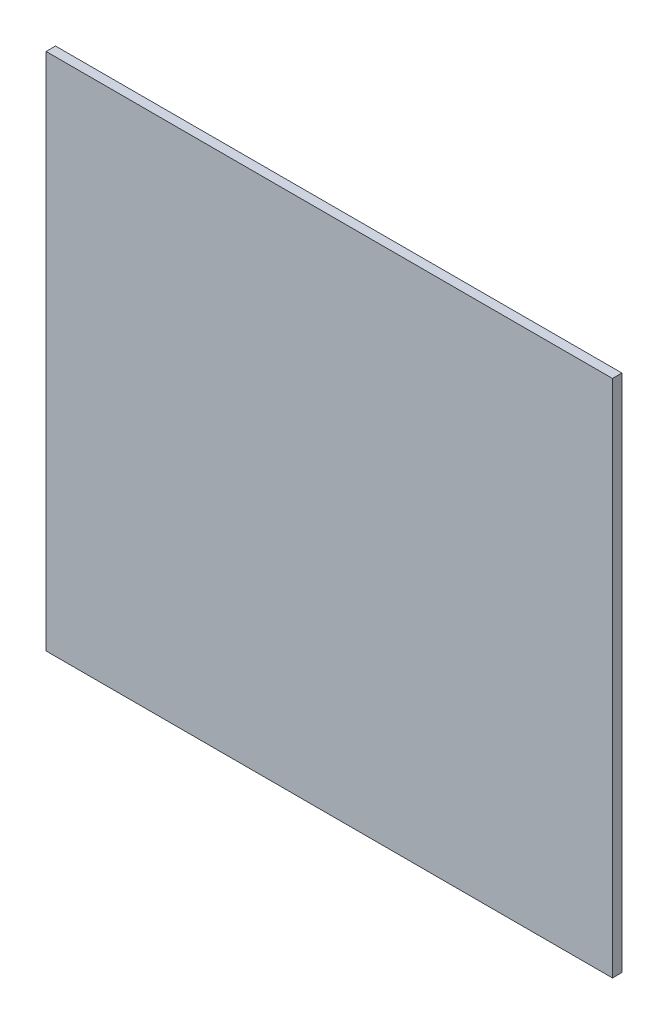
ISO-10303-21;
HEADER;
FILE_DESCRIPTION(('STEP AP214'),'2;1');
FILE_NAME('part.step','',(''),(''),'','','');
FILE_SCHEMA(('AUTOMOTIVE_DESIGN { 1 0 10303 214 1 1 1 1 }'));
ENDSEC;
DATA;
#1=APPLICATION_CONTEXT('core data for automotive mechanical design processes');
#2=APPLICATION_PROTOCOL_DEFINITION('international standard','automotive_design',2000,#1);
#3=PRODUCT_CONTEXT('',#1,'mechanical');
#4=PRODUCT('Part','Part','',(#3));
#5=PRODUCT_RELATED_PRODUCT_CATEGORY('part','',(#4));
#6=PRODUCT_DEFINITION_FORMATION('','',#4);
#7=PRODUCT_DEFINITION_CONTEXT('part definition',#1,'design');
#8=PRODUCT_DEFINITION('design','',#6,#7);
#9=PRODUCT_DEFINITION_SHAPE('','',#8);
#10=(LENGTH_UNIT() NAMED_UNIT(*) SI_UNIT(.MILLI.,.METRE.));
#11=(NAMED_UNIT(*) PLANE_ANGLE_UNIT() SI_UNIT($,.RADIAN.));
#12=(NAMED_UNIT(*) SI_UNIT($,.STERADIAN.) SOLID_ANGLE_UNIT());
#13=UNCERTAINTY_MEASURE_WITH_UNIT(LENGTH_MEASURE(1.E-05),#10,'distance_accuracy_value','');
#14=(GEOMETRIC_REPRESENTATION_CONTEXT(3) GLOBAL_UNCERTAINTY_ASSIGNED_CONTEXT((#13)) GLOBAL_UNIT_ASSIGNED_CONTEXT((#10,
#11,#12)) REPRESENTATION_CONTEXT('',''));
#15=CARTESIAN_POINT('',(0.,0.,0.));
#16=DIRECTION('',(0.,0.,1.));
#17=DIRECTION('',(1.,0.,0.));
#18=AXIS2_PLACEMENT_3D('',#15,#16,#17);
#19=CARTESIAN_POINT('',(0.,0.,10.));
#20=DIRECTION('',(1.,0.,0.));
#21=DIRECTION('',(0.,0.,-1.));
#22=AXIS2_PLACEMENT_3D('',#19,#20,#21);
#23=PLANE('',#22);
#24=DIRECTION('',(0.,-1.,0.));
#25=VECTOR('',#24,1.);
#26=CARTESIAN_POINT('',(0.,0.,0.));
#27=LINE('',#26,#25);
#28=CARTESIAN_POINT('',(0.,550.,0.));
#29=VERTEX_POINT('',#28);
#30=CARTESIAN_POINT('',(0.,0.,0.));
#31=VERTEX_POINT('',#30);
#32=EDGE_CURVE('E96',#29,#31,#27,.T.);
#33=ORIENTED_EDGE('',*,*,#32,.T.);
#34=DIRECTION('',(0.,0.,-1.));
#35=VECTOR('',#34,1.);
#36=CARTESIAN_POINT('',(0.,0.,10.));
#37=LINE('',#36,#35);
#38=CARTESIAN_POINT('',(0.,0.,10.));
#39=VERTEX_POINT('',#38);
#40=EDGE_CURVE('E11',#39,#31,#37,.T.);
#41=ORIENTED_EDGE('',*,*,#40,.F.);
#42=DIRECTION('',(0.,-1.,0.));
#43=VECTOR('',#42,1.);
#44=CARTESIAN_POINT('',(0.,0.,10.));
#45=LINE('',#44,#43);
#46=CARTESIAN_POINT('',(0.,550.,10.));
#47=VERTEX_POINT('',#46);
#48=EDGE_CURVE('E84',#47,#39,#45,.T.);
#49=ORIENTED_EDGE('',*,*,#48,.F.);
#50=DIRECTION('',(0.,0.,-1.));
#51=VECTOR('',#50,1.);
#52=CARTESIAN_POINT('',(0.,550.,10.));
#53=LINE('',#52,#51);
#54=EDGE_CURVE('E92',#47,#29,#53,.T.);
#55=ORIENTED_EDGE('',*,*,#54,.T.);
#56=EDGE_LOOP('',(#33,#41,#49,#55));
#57=FACE_BOUND('',#56,.T.);
#58=ADVANCED_FACE('F33',(#57),#23,.F.);
#59=CARTESIAN_POINT('',(0.,0.,10.));
#60=DIRECTION('',(0.,1.,0.));
#61=DIRECTION('',(0.,0.,1.));
#62=AXIS2_PLACEMENT_3D('',#59,#60,#61);
#63=PLANE('',#62);
#64=DIRECTION('',(1.,0.,0.));
#65=VECTOR('',#64,1.);
#66=CARTESIAN_POINT('',(0.,0.,0.));
#67=LINE('',#66,#65);
#68=CARTESIAN_POINT('',(600.,0.,0.));
#69=VERTEX_POINT('',#68);
#70=EDGE_CURVE('E88',#31,#69,#67,.T.);
#71=ORIENTED_EDGE('',*,*,#70,.T.);
#72=DIRECTION('',(0.,0.,-1.));
#73=VECTOR('',#72,1.);
#74=CARTESIAN_POINT('',(600.,0.,10.));
#75=LINE('',#74,#73);
#76=CARTESIAN_POINT('',(600.,0.,10.));
#77=VERTEX_POINT('',#76);
#78=EDGE_CURVE('E41',#77,#69,#75,.T.);
#79=ORIENTED_EDGE('',*,*,#78,.F.);
#80=DIRECTION('',(1.,0.,0.));
#81=VECTOR('',#80,1.);
#82=CARTESIAN_POINT('',(0.,0.,10.));
#83=LINE('',#82,#81);
#84=EDGE_CURVE('E79',#39,#77,#83,.T.);
#85=ORIENTED_EDGE('',*,*,#84,.F.);
#86=ORIENTED_EDGE('',*,*,#40,.T.);
#87=EDGE_LOOP('',(#71,#79,#85,#86));
#88=FACE_BOUND('',#87,.T.);
#89=ADVANCED_FACE('F87',(#88),#63,.F.);
#90=CARTESIAN_POINT('',(600.,0.,10.));
#91=DIRECTION('',(-1.,0.,0.));
#92=DIRECTION('',(0.,0.,1.));
#93=AXIS2_PLACEMENT_3D('',#90,#91,#92);
#94=PLANE('',#93);
#95=DIRECTION('',(0.,1.,0.));
#96=VECTOR('',#95,1.);
#97=CARTESIAN_POINT('',(600.,0.,0.));
#98=LINE('',#97,#96);
#99=CARTESIAN_POINT('',(600.,550.,0.));
#100=VERTEX_POINT('',#99);
#101=EDGE_CURVE('E66',#69,#100,#98,.T.);
#102=ORIENTED_EDGE('',*,*,#101,.T.);
#103=DIRECTION('',(0.,0.,-1.));
#104=VECTOR('',#103,1.);
#105=CARTESIAN_POINT('',(600.,550.,10.));
#106=LINE('',#105,#104);
#107=CARTESIAN_POINT('',(600.,550.,10.));
#108=VERTEX_POINT('',#107);
#109=EDGE_CURVE('E89',#108,#100,#106,.T.);
#110=ORIENTED_EDGE('',*,*,#109,.F.);
#111=DIRECTION('',(0.,1.,0.));
#112=VECTOR('',#111,1.);
#113=CARTESIAN_POINT('',(600.,0.,10.));
#114=LINE('',#113,#112);
#115=EDGE_CURVE('E82',#77,#108,#114,.T.);
#116=ORIENTED_EDGE('',*,*,#115,.F.);
#117=ORIENTED_EDGE('',*,*,#78,.T.);
#118=EDGE_LOOP('',(#102,#110,#116,#117));
#119=FACE_BOUND('',#118,.T.);
#120=ADVANCED_FACE('F90',(#119),#94,.F.);
#121=CARTESIAN_POINT('',(0.,550.,10.));
#122=DIRECTION('',(0.,-1.,0.));
#123=DIRECTION('',(0.,0.,-1.));
#124=AXIS2_PLACEMENT_3D('',#121,#122,#123);
#125=PLANE('',#124);
#126=DIRECTION('',(-1.,0.,0.));
#127=VECTOR('',#126,1.);
#128=CARTESIAN_POINT('',(0.,550.,0.));
#129=LINE('',#128,#127);
#130=EDGE_CURVE('E72',#100,#29,#129,.T.);
#131=ORIENTED_EDGE('',*,*,#130,.T.);
#132=ORIENTED_EDGE('',*,*,#54,.F.);
#133=DIRECTION('',(-1.,0.,0.));
#134=VECTOR('',#133,1.);
#135=CARTESIAN_POINT('',(0.,550.,10.));
#136=LINE('',#135,#134);
#137=EDGE_CURVE('E49',#108,#47,#136,.T.);
#138=ORIENTED_EDGE('',*,*,#137,.F.);
#139=ORIENTED_EDGE('',*,*,#109,.T.);
#140=EDGE_LOOP('',(#131,#132,#138,#139));
#141=FACE_BOUND('',#140,.T.);
#142=ADVANCED_FACE('F103',(#141),#125,.F.);
#143=CARTESIAN_POINT('',(0.,0.,10.));
#144=DIRECTION('',(0.,0.,-1.));
#145=DIRECTION('',(-1.,0.,0.));
#146=AXIS2_PLACEMENT_3D('',#143,#144,#145);
#147=PLANE('',#146);
#148=ORIENTED_EDGE('',*,*,#48,.T.);
#149=ORIENTED_EDGE('',*,*,#84,.T.);
#150=ORIENTED_EDGE('',*,*,#115,.T.);
#151=ORIENTED_EDGE('',*,*,#137,.T.);
#152=EDGE_LOOP('',(#148,#149,#150,#151));
#153=FACE_BOUND('',#152,.T.);
#154=ADVANCED_FACE('F80',(#153),#147,.F.);
#155=CARTESIAN_POINT('',(0.,0.,0.));
#156=DIRECTION('',(0.,0.,-1.));
#157=DIRECTION('',(-1.,0.,0.));
#158=AXIS2_PLACEMENT_3D('',#155,#156,#157);
#159=PLANE('',#158);
#160=ORIENTED_EDGE('',*,*,#32,.F.);
#161=ORIENTED_EDGE('',*,*,#130,.F.);
#162=ORIENTED_EDGE('',*,*,#101,.F.);
#163=ORIENTED_EDGE('',*,*,#70,.F.);
#164=EDGE_LOOP('',(#160,#161,#162,#163));
#165=FACE_BOUND('',#164,.T.);
#166=ADVANCED_FACE('F106',(#165),#159,.T.);
#167=CLOSED_SHELL('',(#58,#89,#120,#142,#154,#166));
#168=MANIFOLD_SOLID_BREP('B2',#167);
#169=ADVANCED_BREP_SHAPE_REPRESENTATION('',(#18,#168),#14);
#170=SHAPE_DEFINITION_REPRESENTATION(#9,#169);
ENDSEC;
END-ISO-10303-21;
